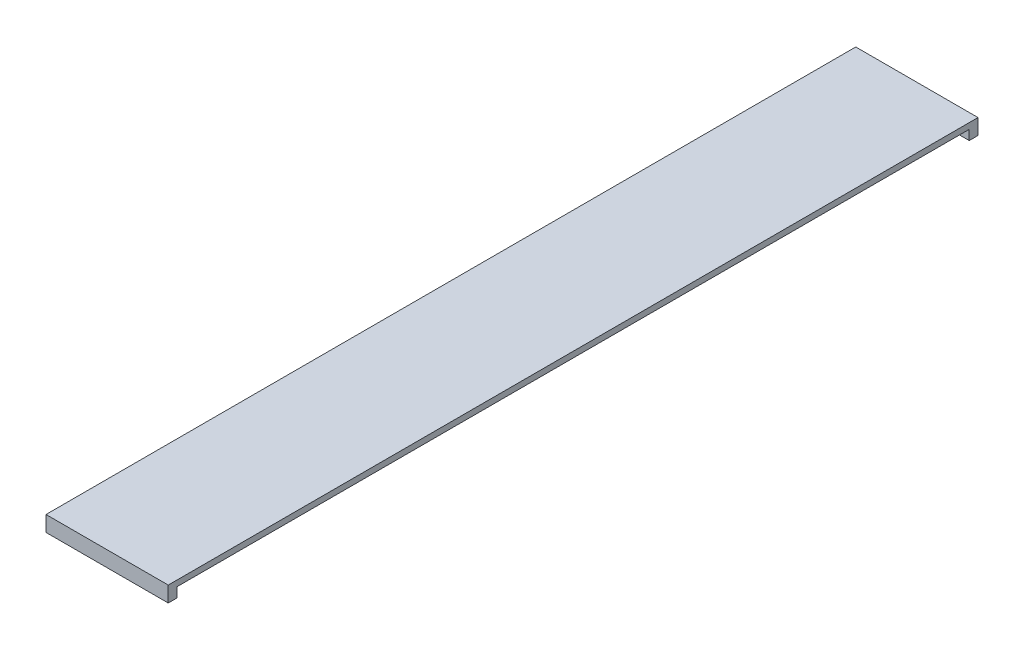
ISO-10303-21;
HEADER;
FILE_DESCRIPTION(('STEP AP214'),'2;1');
FILE_NAME('part.step','',(''),(''),'','','');
FILE_SCHEMA(('AUTOMOTIVE_DESIGN { 1 0 10303 214 1 1 1 1 }'));
ENDSEC;
DATA;
#1=APPLICATION_CONTEXT('core data for automotive mechanical design processes');
#2=APPLICATION_PROTOCOL_DEFINITION('international standard','automotive_design',2000,#1);
#3=PRODUCT_CONTEXT('',#1,'mechanical');
#4=PRODUCT('Part','Part','',(#3));
#5=PRODUCT_RELATED_PRODUCT_CATEGORY('part','',(#4));
#6=PRODUCT_DEFINITION_FORMATION('','',#4);
#7=PRODUCT_DEFINITION_CONTEXT('part definition',#1,'design');
#8=PRODUCT_DEFINITION('design','',#6,#7);
#9=PRODUCT_DEFINITION_SHAPE('','',#8);
#10=(LENGTH_UNIT() NAMED_UNIT(*) SI_UNIT(.MILLI.,.METRE.));
#11=(NAMED_UNIT(*) PLANE_ANGLE_UNIT() SI_UNIT($,.RADIAN.));
#12=(NAMED_UNIT(*) SI_UNIT($,.STERADIAN.) SOLID_ANGLE_UNIT());
#13=UNCERTAINTY_MEASURE_WITH_UNIT(LENGTH_MEASURE(1.E-05),#10,'distance_accuracy_value','');
#14=(GEOMETRIC_REPRESENTATION_CONTEXT(3) GLOBAL_UNCERTAINTY_ASSIGNED_CONTEXT((#13)) GLOBAL_UNIT_ASSIGNED_CONTEXT((#10,
#11,#12)) REPRESENTATION_CONTEXT('',''));
#15=CARTESIAN_POINT('',(0.,0.,0.));
#16=DIRECTION('',(0.,0.,1.));
#17=DIRECTION('',(1.,0.,0.));
#18=AXIS2_PLACEMENT_3D('',#15,#16,#17);
#19=CARTESIAN_POINT('',(398.78,-31.7500000000006,1320.8));
#20=DIRECTION('',(0.,0.,-1.));
#21=DIRECTION('',(-1.,0.,0.));
#22=AXIS2_PLACEMENT_3D('',#19,#20,#21);
#23=PLANE('',#22);
#24=DIRECTION('',(0.,-1.,0.));
#25=VECTOR('',#24,1.);
#26=CARTESIAN_POINT('',(0.,-31.7500000000006,1320.8));
#27=LINE('',#26,#25);
#28=CARTESIAN_POINT('',(0.,19.0499999999997,1320.8));
#29=VERTEX_POINT('',#28);
#30=CARTESIAN_POINT('',(0.,-31.7500000000006,1320.8));
#31=VERTEX_POINT('',#30);
#32=EDGE_CURVE('E135',#29,#31,#27,.T.);
#33=ORIENTED_EDGE('',*,*,#32,.T.);
#34=DIRECTION('',(-1.,0.,0.));
#35=VECTOR('',#34,1.);
#36=CARTESIAN_POINT('',(398.78,-31.7500000000006,1320.8));
#37=LINE('',#36,#35);
#38=CARTESIAN_POINT('',(398.78,-31.7500000000006,1320.8));
#39=VERTEX_POINT('',#38);
#40=EDGE_CURVE('E11',#39,#31,#37,.T.);
#41=ORIENTED_EDGE('',*,*,#40,.F.);
#42=DIRECTION('',(0.,-1.,0.));
#43=VECTOR('',#42,1.);
#44=CARTESIAN_POINT('',(398.78,-31.7500000000006,1320.8));
#45=LINE('',#44,#43);
#46=CARTESIAN_POINT('',(398.78,19.0499999999997,1320.8));
#47=VERTEX_POINT('',#46);
#48=EDGE_CURVE('E149',#47,#39,#45,.T.);
#49=ORIENTED_EDGE('',*,*,#48,.F.);
#50=DIRECTION('',(-1.,0.,0.));
#51=VECTOR('',#50,1.);
#52=CARTESIAN_POINT('',(398.78,19.0499999999997,1320.8));
#53=LINE('',#52,#51);
#54=EDGE_CURVE('E131',#47,#29,#53,.T.);
#55=ORIENTED_EDGE('',*,*,#54,.T.);
#56=EDGE_LOOP('',(#33,#41,#49,#55));
#57=FACE_BOUND('',#56,.T.);
#58=ADVANCED_FACE('F39',(#57),#23,.F.);
#59=CARTESIAN_POINT('',(398.78,-31.7500000000014,1292.225));
#60=DIRECTION('',(0.,1.,0.));
#61=DIRECTION('',(0.,0.,1.));
#62=AXIS2_PLACEMENT_3D('',#59,#60,#61);
#63=PLANE('',#62);
#64=DIRECTION('',(0.,0.,-1.));
#65=VECTOR('',#64,1.);
#66=CARTESIAN_POINT('',(0.,-31.7500000000014,1292.225));
#67=LINE('',#66,#65);
#68=CARTESIAN_POINT('',(0.,-31.7500000000014,1292.225));
#69=VERTEX_POINT('',#68);
#70=EDGE_CURVE('E138',#31,#69,#67,.T.);
#71=ORIENTED_EDGE('',*,*,#70,.T.);
#72=DIRECTION('',(-1.,0.,0.));
#73=VECTOR('',#72,1.);
#74=CARTESIAN_POINT('',(398.78,-31.7500000000014,1292.225));
#75=LINE('',#74,#73);
#76=CARTESIAN_POINT('',(398.78,-31.7500000000014,1292.225));
#77=VERTEX_POINT('',#76);
#78=EDGE_CURVE('E47',#77,#69,#75,.T.);
#79=ORIENTED_EDGE('',*,*,#78,.F.);
#80=DIRECTION('',(0.,0.,-1.));
#81=VECTOR('',#80,1.);
#82=CARTESIAN_POINT('',(398.78,-31.7500000000014,1292.225));
#83=LINE('',#82,#81);
#84=EDGE_CURVE('E98',#39,#77,#83,.T.);
#85=ORIENTED_EDGE('',*,*,#84,.F.);
#86=ORIENTED_EDGE('',*,*,#40,.T.);
#87=EDGE_LOOP('',(#71,#79,#85,#86));
#88=FACE_BOUND('',#87,.T.);
#89=ADVANCED_FACE('F184',(#88),#63,.F.);
#90=CARTESIAN_POINT('',(398.78,-3.68048631769E-13,1292.225));
#91=DIRECTION('',(0.,0.,1.));
#92=DIRECTION('',(1.,0.,0.));
#93=AXIS2_PLACEMENT_3D('',#90,#91,#92);
#94=PLANE('',#93);
#95=DIRECTION('',(0.,1.,0.));
#96=VECTOR('',#95,1.);
#97=CARTESIAN_POINT('',(0.,-3.68048631769E-13,1292.225));
#98=LINE('',#97,#96);
#99=CARTESIAN_POINT('',(0.,-3.68048631769E-13,1292.225));
#100=VERTEX_POINT('',#99);
#101=EDGE_CURVE('E140',#69,#100,#98,.T.);
#102=ORIENTED_EDGE('',*,*,#101,.T.);
#103=DIRECTION('',(-1.,0.,0.));
#104=VECTOR('',#103,1.);
#105=CARTESIAN_POINT('',(398.78,-3.68048631769E-13,1292.225));
#106=LINE('',#105,#104);
#107=CARTESIAN_POINT('',(398.78,-3.68048631769E-13,1292.225));
#108=VERTEX_POINT('',#107);
#109=EDGE_CURVE('E156',#108,#100,#106,.T.);
#110=ORIENTED_EDGE('',*,*,#109,.F.);
#111=DIRECTION('',(0.,1.,0.));
#112=VECTOR('',#111,1.);
#113=CARTESIAN_POINT('',(398.78,-3.68048631769E-13,1292.225));
#114=LINE('',#113,#112);
#115=EDGE_CURVE('E164',#77,#108,#114,.T.);
#116=ORIENTED_EDGE('',*,*,#115,.F.);
#117=ORIENTED_EDGE('',*,*,#78,.T.);
#118=EDGE_LOOP('',(#102,#110,#116,#117));
#119=FACE_BOUND('',#118,.T.);
#120=ADVANCED_FACE('F162',(#119),#94,.F.);
#121=CARTESIAN_POINT('',(398.78,4.24278283844819E-13,-1292.225));
#122=DIRECTION('',(0.,1.,0.));
#123=DIRECTION('',(0.,0.,1.));
#124=AXIS2_PLACEMENT_3D('',#121,#122,#123);
#125=PLANE('',#124);
#126=DIRECTION('',(0.,0.,-1.));
#127=VECTOR('',#126,1.);
#128=CARTESIAN_POINT('',(0.,4.24278283844819E-13,-1292.225));
#129=LINE('',#128,#127);
#130=CARTESIAN_POINT('',(0.,4.24278283844819E-13,-1292.225));
#131=VERTEX_POINT('',#130);
#132=EDGE_CURVE('E142',#100,#131,#129,.T.);
#133=ORIENTED_EDGE('',*,*,#132,.T.);
#134=DIRECTION('',(-1.,0.,0.));
#135=VECTOR('',#134,1.);
#136=CARTESIAN_POINT('',(398.78,4.24278283844819E-13,-1292.225));
#137=LINE('',#136,#135);
#138=CARTESIAN_POINT('',(398.78,4.24278283844819E-13,-1292.225));
#139=VERTEX_POINT('',#138);
#140=EDGE_CURVE('E153',#139,#131,#137,.T.);
#141=ORIENTED_EDGE('',*,*,#140,.F.);
#142=DIRECTION('',(0.,0.,-1.));
#143=VECTOR('',#142,1.);
#144=CARTESIAN_POINT('',(398.78,4.24278283844819E-13,-1292.225));
#145=LINE('',#144,#143);
#146=EDGE_CURVE('E176',#108,#139,#145,.T.);
#147=ORIENTED_EDGE('',*,*,#146,.F.);
#148=ORIENTED_EDGE('',*,*,#109,.T.);
#149=EDGE_LOOP('',(#133,#141,#147,#148));
#150=FACE_BOUND('',#149,.T.);
#151=ADVANCED_FACE('F172',(#150),#125,.F.);
#152=CARTESIAN_POINT('',(398.78,-31.7500000000003,-1292.225));
#153=DIRECTION('',(0.,0.,-1.));
#154=DIRECTION('',(-1.,0.,0.));
#155=AXIS2_PLACEMENT_3D('',#152,#153,#154);
#156=PLANE('',#155);
#157=DIRECTION('',(0.,-1.,0.));
#158=VECTOR('',#157,1.);
#159=CARTESIAN_POINT('',(0.,-31.7500000000003,-1292.225));
#160=LINE('',#159,#158);
#161=CARTESIAN_POINT('',(0.,-31.7500000000003,-1292.225));
#162=VERTEX_POINT('',#161);
#163=EDGE_CURVE('E144',#131,#162,#160,.T.);
#164=ORIENTED_EDGE('',*,*,#163,.T.);
#165=DIRECTION('',(-1.,0.,0.));
#166=VECTOR('',#165,1.);
#167=CARTESIAN_POINT('',(398.78,-31.7500000000003,-1292.225));
#168=LINE('',#167,#166);
#169=CARTESIAN_POINT('',(398.78,-31.7500000000003,-1292.225));
#170=VERTEX_POINT('',#169);
#171=EDGE_CURVE('E126',#170,#162,#168,.T.);
#172=ORIENTED_EDGE('',*,*,#171,.F.);
#173=DIRECTION('',(0.,-1.,0.));
#174=VECTOR('',#173,1.);
#175=CARTESIAN_POINT('',(398.78,-31.7500000000003,-1292.225));
#176=LINE('',#175,#174);
#177=EDGE_CURVE('E117',#139,#170,#176,.T.);
#178=ORIENTED_EDGE('',*,*,#177,.F.);
#179=ORIENTED_EDGE('',*,*,#140,.T.);
#180=EDGE_LOOP('',(#164,#172,#178,#179));
#181=FACE_BOUND('',#180,.T.);
#182=ADVANCED_FACE('F175',(#181),#156,.F.);
#183=CARTESIAN_POINT('',(398.78,-31.7500000000003,-1320.8));
#184=DIRECTION('',(0.,1.,0.));
#185=DIRECTION('',(0.,0.,1.));
#186=AXIS2_PLACEMENT_3D('',#183,#184,#185);
#187=PLANE('',#186);
#188=DIRECTION('',(0.,0.,-1.));
#189=VECTOR('',#188,1.);
#190=CARTESIAN_POINT('',(0.,-31.7500000000003,-1320.8));
#191=LINE('',#190,#189);
#192=CARTESIAN_POINT('',(0.,-31.7500000000003,-1320.8));
#193=VERTEX_POINT('',#192);
#194=EDGE_CURVE('E125',#162,#193,#191,.T.);
#195=ORIENTED_EDGE('',*,*,#194,.T.);
#196=DIRECTION('',(-1.,0.,0.));
#197=VECTOR('',#196,1.);
#198=CARTESIAN_POINT('',(398.78,-31.7500000000003,-1320.8));
#199=LINE('',#198,#197);
#200=CARTESIAN_POINT('',(398.78,-31.7500000000003,-1320.8));
#201=VERTEX_POINT('',#200);
#202=EDGE_CURVE('E122',#201,#193,#199,.T.);
#203=ORIENTED_EDGE('',*,*,#202,.F.);
#204=DIRECTION('',(0.,0.,-1.));
#205=VECTOR('',#204,1.);
#206=CARTESIAN_POINT('',(398.78,-31.7500000000003,-1320.8));
#207=LINE('',#206,#205);
#208=EDGE_CURVE('E111',#170,#201,#207,.T.);
#209=ORIENTED_EDGE('',*,*,#208,.F.);
#210=ORIENTED_EDGE('',*,*,#171,.T.);
#211=EDGE_LOOP('',(#195,#203,#209,#210));
#212=FACE_BOUND('',#211,.T.);
#213=ADVANCED_FACE('F123',(#212),#187,.F.);
#214=CARTESIAN_POINT('',(398.78,19.0499999999997,-1320.8));
#215=DIRECTION('',(0.,0.,1.));
#216=DIRECTION('',(1.,0.,0.));
#217=AXIS2_PLACEMENT_3D('',#214,#215,#216);
#218=PLANE('',#217);
#219=DIRECTION('',(0.,1.,0.));
#220=VECTOR('',#219,1.);
#221=CARTESIAN_POINT('',(0.,19.0499999999997,-1320.8));
#222=LINE('',#221,#220);
#223=CARTESIAN_POINT('',(0.,19.0499999999997,-1320.8));
#224=VERTEX_POINT('',#223);
#225=EDGE_CURVE('E84',#193,#224,#222,.T.);
#226=ORIENTED_EDGE('',*,*,#225,.T.);
#227=DIRECTION('',(-1.,0.,0.));
#228=VECTOR('',#227,1.);
#229=CARTESIAN_POINT('',(398.78,19.0499999999997,-1320.8));
#230=LINE('',#229,#228);
#231=CARTESIAN_POINT('',(398.78,19.0499999999997,-1320.8));
#232=VERTEX_POINT('',#231);
#233=EDGE_CURVE('E127',#232,#224,#230,.T.);
#234=ORIENTED_EDGE('',*,*,#233,.F.);
#235=DIRECTION('',(0.,1.,0.));
#236=VECTOR('',#235,1.);
#237=CARTESIAN_POINT('',(398.78,19.0499999999997,-1320.8));
#238=LINE('',#237,#236);
#239=EDGE_CURVE('E115',#201,#232,#238,.T.);
#240=ORIENTED_EDGE('',*,*,#239,.F.);
#241=ORIENTED_EDGE('',*,*,#202,.T.);
#242=EDGE_LOOP('',(#226,#234,#240,#241));
#243=FACE_BOUND('',#242,.T.);
#244=ADVANCED_FACE('F129',(#243),#218,.F.);
#245=CARTESIAN_POINT('',(398.78,19.0499999999997,1320.8));
#246=DIRECTION('',(0.,-1.,0.));
#247=DIRECTION('',(0.,0.,-1.));
#248=AXIS2_PLACEMENT_3D('',#245,#246,#247);
#249=PLANE('',#248);
#250=DIRECTION('',(0.,0.,1.));
#251=VECTOR('',#250,1.);
#252=CARTESIAN_POINT('',(0.,19.0499999999997,1320.8));
#253=LINE('',#252,#251);
#254=EDGE_CURVE('E90',#224,#29,#253,.T.);
#255=ORIENTED_EDGE('',*,*,#254,.T.);
#256=ORIENTED_EDGE('',*,*,#54,.F.);
#257=DIRECTION('',(0.,0.,1.));
#258=VECTOR('',#257,1.);
#259=CARTESIAN_POINT('',(398.78,19.0499999999997,1320.8));
#260=LINE('',#259,#258);
#261=EDGE_CURVE('E55',#232,#47,#260,.T.);
#262=ORIENTED_EDGE('',*,*,#261,.F.);
#263=ORIENTED_EDGE('',*,*,#233,.T.);
#264=EDGE_LOOP('',(#255,#256,#262,#263));
#265=FACE_BOUND('',#264,.T.);
#266=ADVANCED_FACE('F200',(#265),#249,.F.);
#267=CARTESIAN_POINT('',(398.78,0.,0.));
#268=DIRECTION('',(-1.,0.,0.));
#269=DIRECTION('',(0.,0.,1.));
#270=AXIS2_PLACEMENT_3D('',#267,#268,#269);
#271=PLANE('',#270);
#272=ORIENTED_EDGE('',*,*,#48,.T.);
#273=ORIENTED_EDGE('',*,*,#84,.T.);
#274=ORIENTED_EDGE('',*,*,#115,.T.);
#275=ORIENTED_EDGE('',*,*,#146,.T.);
#276=ORIENTED_EDGE('',*,*,#177,.T.);
#277=ORIENTED_EDGE('',*,*,#208,.T.);
#278=ORIENTED_EDGE('',*,*,#239,.T.);
#279=ORIENTED_EDGE('',*,*,#261,.T.);
#280=EDGE_LOOP('',(#272,#273,#274,#275,#276,#277,#278,#279));
#281=FACE_BOUND('',#280,.T.);
#282=ADVANCED_FACE('F113',(#281),#271,.F.);
#283=CARTESIAN_POINT('',(0.,0.,0.));
#284=DIRECTION('',(-1.,0.,0.));
#285=DIRECTION('',(0.,0.,1.));
#286=AXIS2_PLACEMENT_3D('',#283,#284,#285);
#287=PLANE('',#286);
#288=ORIENTED_EDGE('',*,*,#32,.F.);
#289=ORIENTED_EDGE('',*,*,#254,.F.);
#290=ORIENTED_EDGE('',*,*,#225,.F.);
#291=ORIENTED_EDGE('',*,*,#194,.F.);
#292=ORIENTED_EDGE('',*,*,#163,.F.);
#293=ORIENTED_EDGE('',*,*,#132,.F.);
#294=ORIENTED_EDGE('',*,*,#101,.F.);
#295=ORIENTED_EDGE('',*,*,#70,.F.);
#296=EDGE_LOOP('',(#288,#289,#290,#291,#292,#293,#294,#295));
#297=FACE_BOUND('',#296,.T.);
#298=ADVANCED_FACE('F168',(#297),#287,.T.);
#299=CLOSED_SHELL('',(#58,#89,#120,#151,#182,#213,#244,#266,#282,#298));
#300=MANIFOLD_SOLID_BREP('B2',#299);
#301=ADVANCED_BREP_SHAPE_REPRESENTATION('',(#18,#300),#14);
#302=SHAPE_DEFINITION_REPRESENTATION(#9,#301);
ENDSEC;
END-ISO-10303-21;
